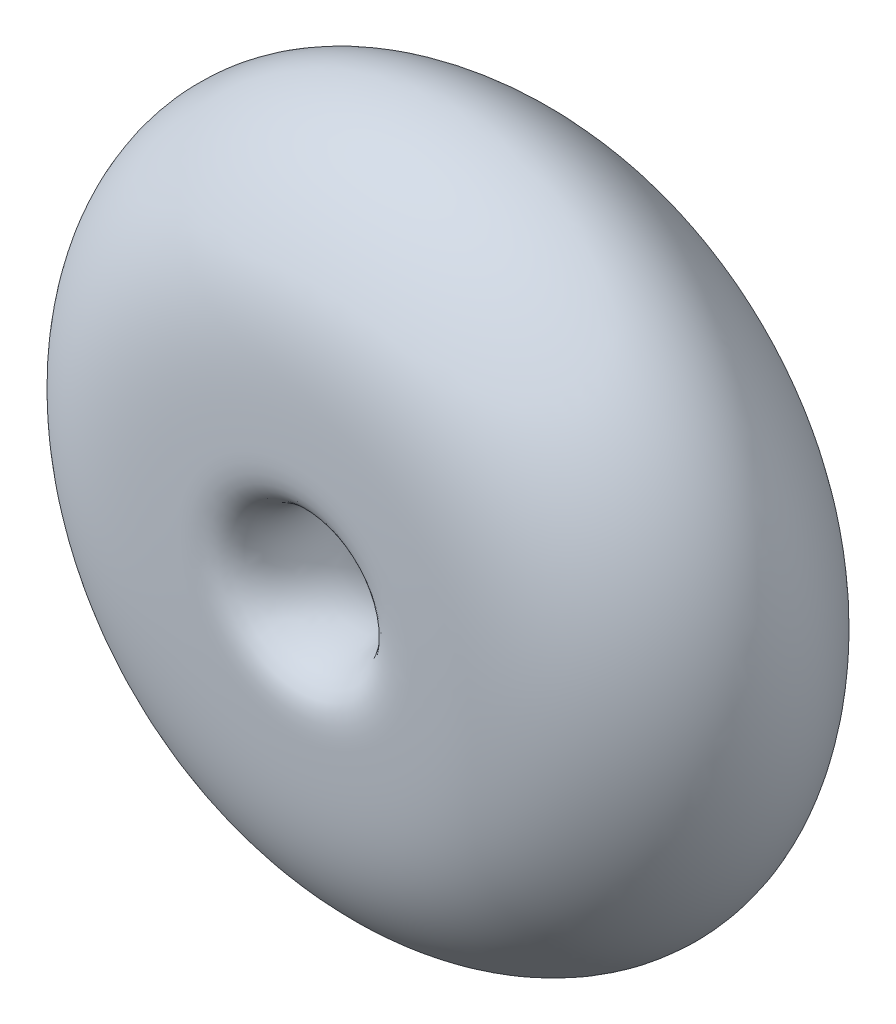
ISO-10303-21;
HEADER;
FILE_DESCRIPTION(('STEP AP214'),'2;1');
FILE_NAME('part.step','',(''),(''),'','','');
FILE_SCHEMA(('AUTOMOTIVE_DESIGN { 1 0 10303 214 1 1 1 1 }'));
ENDSEC;
DATA;
#1=APPLICATION_CONTEXT('core data for automotive mechanical design processes');
#2=APPLICATION_PROTOCOL_DEFINITION('international standard','automotive_design',2000,#1);
#3=PRODUCT_CONTEXT('',#1,'mechanical');
#4=PRODUCT('Part','Part','',(#3));
#5=PRODUCT_RELATED_PRODUCT_CATEGORY('part','',(#4));
#6=PRODUCT_DEFINITION_FORMATION('','',#4);
#7=PRODUCT_DEFINITION_CONTEXT('part definition',#1,'design');
#8=PRODUCT_DEFINITION('design','',#6,#7);
#9=PRODUCT_DEFINITION_SHAPE('','',#8);
#10=(LENGTH_UNIT() NAMED_UNIT(*) SI_UNIT(.MILLI.,.METRE.));
#11=(NAMED_UNIT(*) PLANE_ANGLE_UNIT() SI_UNIT($,.RADIAN.));
#12=(NAMED_UNIT(*) SI_UNIT($,.STERADIAN.) SOLID_ANGLE_UNIT());
#13=UNCERTAINTY_MEASURE_WITH_UNIT(LENGTH_MEASURE(1.E-05),#10,'distance_accuracy_value','');
#14=(GEOMETRIC_REPRESENTATION_CONTEXT(3) GLOBAL_UNCERTAINTY_ASSIGNED_CONTEXT((#13)) GLOBAL_UNIT_ASSIGNED_CONTEXT((#10,
#11,#12)) REPRESENTATION_CONTEXT('',''));
#15=CARTESIAN_POINT('',(0.,0.,0.));
#16=DIRECTION('',(0.,0.,1.));
#17=DIRECTION('',(1.,0.,0.));
#18=AXIS2_PLACEMENT_3D('',#15,#16,#17);
#19=CARTESIAN_POINT('',(0.,0.,-1.04326549420539));
#20=CARTESIAN_POINT('',(2.37266948642058,0.,0.174415731499924));
#21=CARTESIAN_POINT('',(16.0600670729959,0.,-0.203984959547969));
#22=CARTESIAN_POINT('',(40.771776971812,0.,-0.94766687593469));
#23=CARTESIAN_POINT('',(70.588129603173,0.,-37.6222164159258));
#24=CARTESIAN_POINT('',(20.2498258127486,0.,-75.5860100836338));
#25=CARTESIAN_POINT('',(29.0545133199505,0.,-30.5650602221532));
#26=CARTESIAN_POINT('',(-6.67776127095184,0.,-36.6984991576006));
#27=CARTESIAN_POINT('',(-7.44641255197945,0.,-4.86484992275585));
#28=CARTESIAN_POINT('',(0.,0.,-1.04326549420539));
#29=B_SPLINE_CURVE_WITH_KNOTS('',3,(#19,#20,#21,#22,#23,#24,#25,#26,#27,#28),.UNSPECIFIED.,.T.,
.F.,(4,1,1,1,1,1,1,4),(0.,0.0467275660837277,0.201787528303981,0.413606645756583,
0.599322515872742,0.720091609611037,0.853349682035047,1.),.UNSPECIFIED.);
#30=CARTESIAN_POINT('',(-17.2486561708625,0.,-66.5603385303042));
#31=DIRECTION('',(0.,0.,-1.));
#32=AXIS1_PLACEMENT('',#30,#31);
#33=SURFACE_OF_REVOLUTION('',#29,#32);
#34=ADVANCED_FACE('F34',(),#33,.T.);
#35=CLOSED_SHELL('',(#34));
#36=MANIFOLD_SOLID_BREP('B2',#35);
#37=ADVANCED_BREP_SHAPE_REPRESENTATION('',(#18,#36),#14);
#38=SHAPE_DEFINITION_REPRESENTATION(#9,#37);
ENDSEC;
END-ISO-10303-21;
